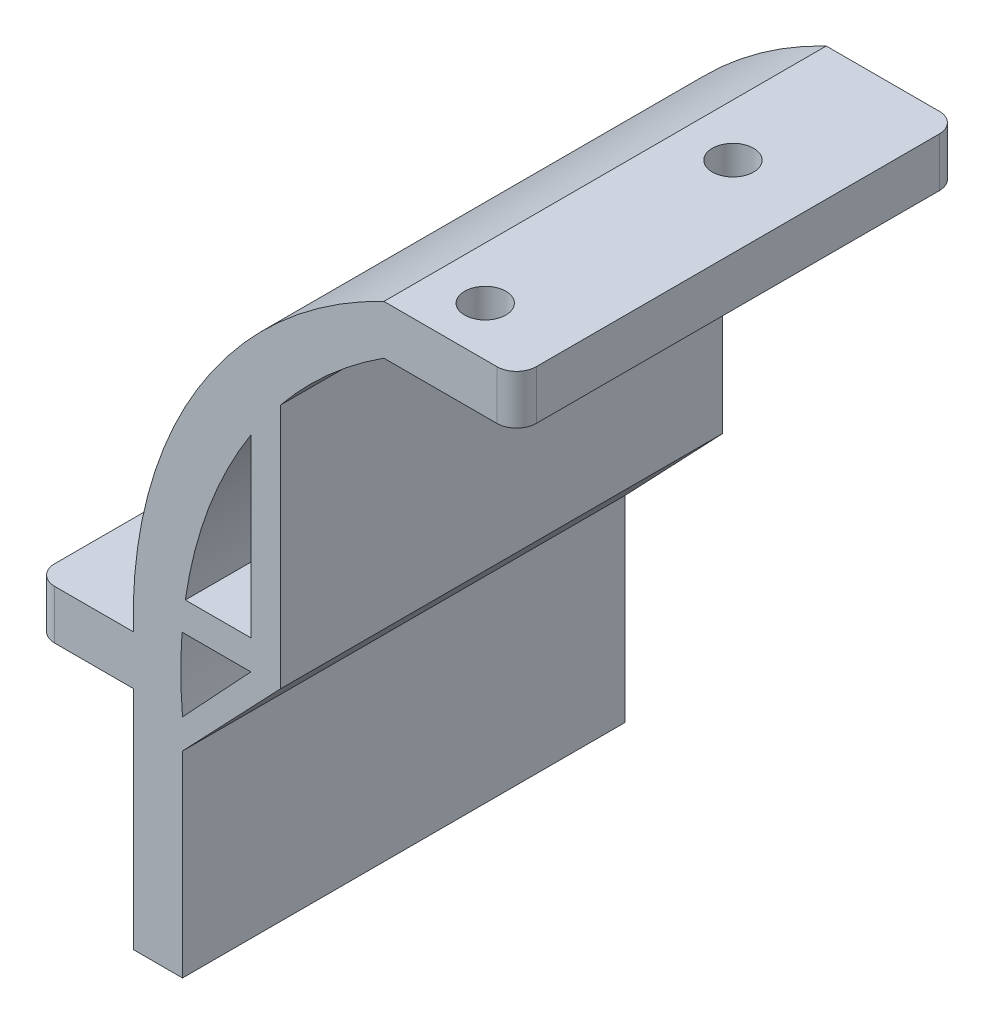
ISO-10303-21;
HEADER;
FILE_DESCRIPTION(('STEP AP214'),'2;1');
FILE_NAME('part.step','',(''),(''),'','','');
FILE_SCHEMA(('AUTOMOTIVE_DESIGN { 1 0 10303 214 1 1 1 1 }'));
ENDSEC;
DATA;
#1=APPLICATION_CONTEXT('core data for automotive mechanical design processes');
#2=APPLICATION_PROTOCOL_DEFINITION('international standard','automotive_design',2000,#1);
#3=PRODUCT_CONTEXT('',#1,'mechanical');
#4=PRODUCT('Part','Part','',(#3));
#5=PRODUCT_RELATED_PRODUCT_CATEGORY('part','',(#4));
#6=PRODUCT_DEFINITION_FORMATION('','',#4);
#7=PRODUCT_DEFINITION_CONTEXT('part definition',#1,'design');
#8=PRODUCT_DEFINITION('design','',#6,#7);
#9=PRODUCT_DEFINITION_SHAPE('','',#8);
#10=(LENGTH_UNIT() NAMED_UNIT(*) SI_UNIT(.MILLI.,.METRE.));
#11=(NAMED_UNIT(*) PLANE_ANGLE_UNIT() SI_UNIT($,.RADIAN.));
#12=(NAMED_UNIT(*) SI_UNIT($,.STERADIAN.) SOLID_ANGLE_UNIT());
#13=UNCERTAINTY_MEASURE_WITH_UNIT(LENGTH_MEASURE(1.E-05),#10,'distance_accuracy_value','');
#14=(GEOMETRIC_REPRESENTATION_CONTEXT(3) GLOBAL_UNCERTAINTY_ASSIGNED_CONTEXT((#13)) GLOBAL_UNIT_ASSIGNED_CONTEXT((#10,
#11,#12)) REPRESENTATION_CONTEXT('',''));
#15=CARTESIAN_POINT('',(0.,0.,0.));
#16=DIRECTION('',(0.,0.,1.));
#17=DIRECTION('',(1.,0.,0.));
#18=AXIS2_PLACEMENT_3D('',#15,#16,#17);
#19=CARTESIAN_POINT('',(19.2704077275692,219.412639915224,45.));
#20=DIRECTION('',(0.,0.,-1.));
#21=DIRECTION('',(-1.,0.,0.));
#22=AXIS2_PLACEMENT_3D('',#19,#20,#21);
#23=CYLINDRICAL_SURFACE('',#22,45.);
#24=DIRECTION('',(0.,0.,1.));
#25=VECTOR('',#24,1.);
#26=CARTESIAN_POINT('',(-25.5973694260722,222.859750776681,0.));
#27=LINE('',#26,#25);
#28=CARTESIAN_POINT('',(-25.5973694260722,222.859750776681,0.));
#29=VERTEX_POINT('',#28);
#30=CARTESIAN_POINT('',(-25.5973694260722,222.859750776681,45.));
#31=VERTEX_POINT('',#30);
#32=EDGE_CURVE('E216',#29,#31,#27,.T.);
#33=ORIENTED_EDGE('',*,*,#32,.T.);
#34=CARTESIAN_POINT('',(19.2704077275692,219.412639915224,45.));
#35=DIRECTION('',(0.,0.,1.));
#36=DIRECTION('',(1.,0.,0.));
#37=AXIS2_PLACEMENT_3D('',#34,#35,#36);
#38=CIRCLE('',#37,45.);
#39=CARTESIAN_POINT('',(-25.5516147708674,215.414352888303,45.));
#40=VERTEX_POINT('',#39);
#41=EDGE_CURVE('E293',#31,#40,#38,.T.);
#42=ORIENTED_EDGE('',*,*,#41,.T.);
#43=DIRECTION('',(0.,0.,-1.));
#44=VECTOR('',#43,1.);
#45=CARTESIAN_POINT('',(-25.5516147708674,215.414352888303,45.));
#46=LINE('',#45,#44);
#47=CARTESIAN_POINT('',(-25.5516147708674,215.414352888303,0.));
#48=VERTEX_POINT('',#47);
#49=EDGE_CURVE('E319',#40,#48,#46,.T.);
#50=ORIENTED_EDGE('',*,*,#49,.T.);
#51=CARTESIAN_POINT('',(19.2704077275692,219.412639915224,0.));
#52=DIRECTION('',(0.,0.,1.));
#53=DIRECTION('',(1.,0.,0.));
#54=AXIS2_PLACEMENT_3D('',#51,#52,#53);
#55=CIRCLE('',#54,45.);
#56=EDGE_CURVE('E209',#29,#48,#55,.T.);
#57=ORIENTED_EDGE('',*,*,#56,.F.);
#58=EDGE_LOOP('',(#33,#42,#50,#57));
#59=FACE_BOUND('',#58,.T.);
#60=ADVANCED_FACE('F39',(#59),#23,.F.);
#61=DIRECTION('',(0.,0.,1.));
#62=VECTOR('',#61,1.);
#63=CARTESIAN_POINT('',(-15.5973694260722,247.859750776681,0.));
#64=LINE('',#63,#62);
#65=CARTESIAN_POINT('',(-15.5973694260722,247.859750776681,0.));
#66=VERTEX_POINT('',#65);
#67=CARTESIAN_POINT('',(-15.5973694260722,247.859750776681,45.));
#68=VERTEX_POINT('',#67);
#69=EDGE_CURVE('E244',#66,#68,#64,.T.);
#70=ORIENTED_EDGE('',*,*,#69,.F.);
#71=CARTESIAN_POINT('',(-5.06519953005821,257.264696918807,0.));
#72=VERTEX_POINT('',#71);
#73=EDGE_CURVE('E320',#72,#66,#55,.T.);
#74=ORIENTED_EDGE('',*,*,#73,.F.);
#75=DIRECTION('',(0.,0.,-1.));
#76=VECTOR('',#75,1.);
#77=CARTESIAN_POINT('',(-5.06519953005821,257.264696918807,45.));
#78=LINE('',#77,#76);
#79=CARTESIAN_POINT('',(-5.06519953005821,257.264696918807,45.));
#80=VERTEX_POINT('',#79);
#81=EDGE_CURVE('E389',#80,#72,#78,.T.);
#82=ORIENTED_EDGE('',*,*,#81,.F.);
#83=EDGE_CURVE('E287',#80,#68,#38,.T.);
#84=ORIENTED_EDGE('',*,*,#83,.T.);
#85=EDGE_LOOP('',(#70,#74,#82,#84));
#86=FACE_BOUND('',#85,.T.);
#87=ADVANCED_FACE('F467',(#86),#23,.F.);
#88=DIRECTION('',(0.,0.,1.));
#89=VECTOR('',#88,1.);
#90=CARTESIAN_POINT('',(-25.2653617340679,225.859750776681,0.));
#91=LINE('',#90,#89);
#92=CARTESIAN_POINT('',(-25.2653617340679,225.859750776681,0.));
#93=VERTEX_POINT('',#92);
#94=CARTESIAN_POINT('',(-25.2653617340679,225.859750776681,45.));
#95=VERTEX_POINT('',#94);
#96=EDGE_CURVE('E254',#93,#95,#91,.T.);
#97=ORIENTED_EDGE('',*,*,#96,.F.);
#98=CARTESIAN_POINT('',(-18.5973694260722,243.723778379767,0.));
#99=VERTEX_POINT('',#98);
#100=EDGE_CURVE('E325',#99,#93,#55,.T.);
#101=ORIENTED_EDGE('',*,*,#100,.F.);
#102=DIRECTION('',(0.,0.,1.));
#103=VECTOR('',#102,1.);
#104=CARTESIAN_POINT('',(-18.5973694260722,243.723778379767,0.));
#105=LINE('',#104,#103);
#106=CARTESIAN_POINT('',(-18.5973694260722,243.723778379767,45.));
#107=VERTEX_POINT('',#106);
#108=EDGE_CURVE('E223',#99,#107,#105,.T.);
#109=ORIENTED_EDGE('',*,*,#108,.T.);
#110=EDGE_CURVE('E292',#107,#95,#38,.T.);
#111=ORIENTED_EDGE('',*,*,#110,.T.);
#112=EDGE_LOOP('',(#97,#101,#109,#111));
#113=FACE_BOUND('',#112,.T.);
#114=ADVANCED_FACE('F470',(#113),#23,.F.);
#115=CARTESIAN_POINT('',(0.,257.264696918807,45.));
#116=DIRECTION('',(0.,-1.,0.));
#117=DIRECTION('',(0.,0.,-1.));
#118=AXIS2_PLACEMENT_3D('',#115,#116,#117);
#119=PLANE('',#118);
#120=CARTESIAN_POINT('',(0.244800469941791,257.264696918807,40.));
#121=DIRECTION('',(0.,-1.,0.));
#122=DIRECTION('',(0.,0.,-1.));
#123=AXIS2_PLACEMENT_3D('',#120,#121,#122);
#124=CIRCLE('',#123,2.1);
#125=CARTESIAN_POINT('',(0.244800469941791,257.264696918807,37.9));
#126=VERTEX_POINT('',#125);
#127=EDGE_CURVE('E283',#126,#126,#124,.T.);
#128=ORIENTED_EDGE('',*,*,#127,.F.);
#129=EDGE_LOOP('',(#128));
#130=FACE_BOUND('',#129,.T.);
#131=CARTESIAN_POINT('',(0.244800469941791,257.264696918807,14.8));
#132=DIRECTION('',(0.,-1.,0.));
#133=DIRECTION('',(0.,0.,-1.));
#134=AXIS2_PLACEMENT_3D('',#131,#132,#133);
#135=CIRCLE('',#134,2.1);
#136=CARTESIAN_POINT('',(0.244800469941791,257.264696918807,12.7));
#137=VERTEX_POINT('',#136);
#138=EDGE_CURVE('E275',#137,#137,#135,.T.);
#139=ORIENTED_EDGE('',*,*,#138,.F.);
#140=EDGE_LOOP('',(#139));
#141=FACE_BOUND('',#140,.T.);
#142=DIRECTION('',(-1.,0.,0.));
#143=VECTOR('',#142,1.);
#144=CARTESIAN_POINT('',(0.,257.264696918807,0.));
#145=LINE('',#144,#143);
#146=CARTESIAN_POINT('',(6.43480046994179,257.264696918807,0.));
#147=VERTEX_POINT('',#146);
#148=EDGE_CURVE('E324',#147,#72,#145,.T.);
#149=ORIENTED_EDGE('',*,*,#148,.F.);
#150=CARTESIAN_POINT('',(6.43480046994179,257.264696918807,2.));
#151=DIRECTION('',(0.,-1.,0.));
#152=DIRECTION('',(0.,0.,-1.));
#153=AXIS2_PLACEMENT_3D('',#150,#151,#152);
#154=CIRCLE('',#153,2.);
#155=CARTESIAN_POINT('',(8.43480046994179,257.264696918807,2.00000000000002));
#156=VERTEX_POINT('',#155);
#157=EDGE_CURVE('E429',#147,#156,#154,.T.);
#158=ORIENTED_EDGE('',*,*,#157,.T.);
#159=DIRECTION('',(0.,0.,-1.));
#160=VECTOR('',#159,1.);
#161=CARTESIAN_POINT('',(8.43480046994179,257.264696918807,45.));
#162=LINE('',#161,#160);
#163=CARTESIAN_POINT('',(8.43480046994179,257.264696918807,43.));
#164=VERTEX_POINT('',#163);
#165=EDGE_CURVE('E385',#164,#156,#162,.T.);
#166=ORIENTED_EDGE('',*,*,#165,.F.);
#167=CARTESIAN_POINT('',(6.43480046994179,257.264696918807,43.));
#168=DIRECTION('',(0.,-1.,0.));
#169=DIRECTION('',(0.,0.,-1.));
#170=AXIS2_PLACEMENT_3D('',#167,#168,#169);
#171=CIRCLE('',#170,2.);
#172=CARTESIAN_POINT('',(6.43480046994179,257.264696918807,45.));
#173=VERTEX_POINT('',#172);
#174=EDGE_CURVE('E426',#164,#173,#171,.T.);
#175=ORIENTED_EDGE('',*,*,#174,.T.);
#176=DIRECTION('',(-1.,0.,0.));
#177=VECTOR('',#176,1.);
#178=CARTESIAN_POINT('',(0.,257.264696918807,45.));
#179=LINE('',#178,#177);
#180=EDGE_CURVE('E291',#173,#80,#179,.T.);
#181=ORIENTED_EDGE('',*,*,#180,.T.);
#182=ORIENTED_EDGE('',*,*,#81,.T.);
#183=EDGE_LOOP('',(#149,#158,#166,#175,#181,#182));
#184=FACE_BOUND('',#183,.T.);
#185=ADVANCED_FACE('F478',(#130,#141,#184),#119,.T.);
#186=CARTESIAN_POINT('',(8.43480046994179,0.,45.));
#187=DIRECTION('',(1.,0.,0.));
#188=DIRECTION('',(0.,0.,-1.));
#189=AXIS2_PLACEMENT_3D('',#186,#187,#188);
#190=PLANE('',#189);
#191=ORIENTED_EDGE('',*,*,#165,.T.);
#192=DIRECTION('',(0.,-1.,0.));
#193=VECTOR('',#192,1.);
#194=CARTESIAN_POINT('',(8.43480046994179,262.264696918807,2.));
#195=LINE('',#194,#193);
#196=CARTESIAN_POINT('',(8.43480046994179,262.264696918807,2.00000000000002));
#197=VERTEX_POINT('',#196);
#198=EDGE_CURVE('E436',#156,#197,#195,.F.);
#199=ORIENTED_EDGE('',*,*,#198,.T.);
#200=DIRECTION('',(0.,0.,-1.));
#201=VECTOR('',#200,1.);
#202=CARTESIAN_POINT('',(8.43480046994179,262.264696918807,45.));
#203=LINE('',#202,#201);
#204=CARTESIAN_POINT('',(8.43480046994179,262.264696918807,43.));
#205=VERTEX_POINT('',#204);
#206=EDGE_CURVE('E381',#205,#197,#203,.T.);
#207=ORIENTED_EDGE('',*,*,#206,.F.);
#208=DIRECTION('',(0.,-1.,0.));
#209=VECTOR('',#208,1.);
#210=CARTESIAN_POINT('',(8.43480046994179,0.,43.));
#211=LINE('',#210,#209);
#212=EDGE_CURVE('E432',#205,#164,#211,.T.);
#213=ORIENTED_EDGE('',*,*,#212,.T.);
#214=EDGE_LOOP('',(#191,#199,#207,#213));
#215=FACE_BOUND('',#214,.T.);
#216=ADVANCED_FACE('F483',(#215),#190,.T.);
#217=CARTESIAN_POINT('',(0.,262.264696918807,45.));
#218=DIRECTION('',(0.,-1.,0.));
#219=DIRECTION('',(0.,0.,-1.));
#220=AXIS2_PLACEMENT_3D('',#217,#218,#219);
#221=PLANE('',#220);
#222=CARTESIAN_POINT('',(0.244800469941791,262.264696918807,40.));
#223=DIRECTION('',(0.,1.,0.));
#224=DIRECTION('',(0.,0.,1.));
#225=AXIS2_PLACEMENT_3D('',#222,#223,#224);
#226=CIRCLE('',#225,2.1);
#227=CARTESIAN_POINT('',(0.244800469941791,262.264696918807,42.1));
#228=VERTEX_POINT('',#227);
#229=EDGE_CURVE('E271',#228,#228,#226,.T.);
#230=ORIENTED_EDGE('',*,*,#229,.F.);
#231=EDGE_LOOP('',(#230));
#232=FACE_BOUND('',#231,.T.);
#233=CARTESIAN_POINT('',(0.244800469941791,262.264696918807,14.8));
#234=DIRECTION('',(0.,1.,0.));
#235=DIRECTION('',(0.,0.,1.));
#236=AXIS2_PLACEMENT_3D('',#233,#234,#235);
#237=CIRCLE('',#236,2.1);
#238=CARTESIAN_POINT('',(0.244800469941791,262.264696918807,16.9));
#239=VERTEX_POINT('',#238);
#240=EDGE_CURVE('E276',#239,#239,#237,.T.);
#241=ORIENTED_EDGE('',*,*,#240,.F.);
#242=EDGE_LOOP('',(#241));
#243=FACE_BOUND('',#242,.T.);
#244=ORIENTED_EDGE('',*,*,#206,.T.);
#245=CARTESIAN_POINT('',(6.43480046994179,262.264696918807,2.));
#246=DIRECTION('',(0.,-1.,0.));
#247=DIRECTION('',(0.,0.,-1.));
#248=AXIS2_PLACEMENT_3D('',#245,#246,#247);
#249=CIRCLE('',#248,2.);
#250=CARTESIAN_POINT('',(6.43480046994179,262.264696918807,0.));
#251=VERTEX_POINT('',#250);
#252=EDGE_CURVE('E11',#197,#251,#249,.F.);
#253=ORIENTED_EDGE('',*,*,#252,.T.);
#254=DIRECTION('',(-1.,0.,0.));
#255=VECTOR('',#254,1.);
#256=CARTESIAN_POINT('',(0.,262.264696918807,0.));
#257=LINE('',#256,#255);
#258=CARTESIAN_POINT('',(-5.06519953005821,262.264696918807,0.));
#259=VERTEX_POINT('',#258);
#260=EDGE_CURVE('E328',#251,#259,#257,.T.);
#261=ORIENTED_EDGE('',*,*,#260,.T.);
#262=DIRECTION('',(0.,0.,-1.));
#263=VECTOR('',#262,1.);
#264=CARTESIAN_POINT('',(-5.06519953005821,262.264696918807,45.));
#265=LINE('',#264,#263);
#266=CARTESIAN_POINT('',(-5.06519953005821,262.264696918807,45.));
#267=VERTEX_POINT('',#266);
#268=EDGE_CURVE('E377',#267,#259,#265,.T.);
#269=ORIENTED_EDGE('',*,*,#268,.F.);
#270=DIRECTION('',(-1.,0.,0.));
#271=VECTOR('',#270,1.);
#272=CARTESIAN_POINT('',(0.,262.264696918807,45.));
#273=LINE('',#272,#271);
#274=CARTESIAN_POINT('',(6.43480046994179,262.264696918807,45.));
#275=VERTEX_POINT('',#274);
#276=EDGE_CURVE('E296',#275,#267,#273,.T.);
#277=ORIENTED_EDGE('',*,*,#276,.F.);
#278=CARTESIAN_POINT('',(6.43480046994179,262.264696918807,43.));
#279=DIRECTION('',(0.,-1.,0.));
#280=DIRECTION('',(0.,0.,-1.));
#281=AXIS2_PLACEMENT_3D('',#278,#279,#280);
#282=CIRCLE('',#281,2.);
#283=EDGE_CURVE('E49',#275,#205,#282,.F.);
#284=ORIENTED_EDGE('',*,*,#283,.T.);
#285=EDGE_LOOP('',(#244,#253,#261,#269,#277,#284));
#286=FACE_BOUND('',#285,.T.);
#287=ADVANCED_FACE('F593',(#232,#243,#286),#221,.F.);
#288=CARTESIAN_POINT('',(14.4298215899234,221.70678583439,45.));
#289=DIRECTION('',(0.,0.,-1.));
#290=DIRECTION('',(-1.,0.,0.));
#291=AXIS2_PLACEMENT_3D('',#288,#289,#290);
#292=CYLINDRICAL_SURFACE('',#291,45.);
#293=CARTESIAN_POINT('',(14.4298215899234,221.70678583439,0.));
#294=DIRECTION('',(0.,0.,1.));
#295=DIRECTION('',(1.,0.,0.));
#296=AXIS2_PLACEMENT_3D('',#293,#294,#295);
#297=CIRCLE('',#296,45.);
#298=CARTESIAN_POINT('',(-30.5516147708674,220.414352888303,0.));
#299=VERTEX_POINT('',#298);
#300=EDGE_CURVE('E331',#299,#259,#297,.F.);
#301=ORIENTED_EDGE('',*,*,#300,.F.);
#302=DIRECTION('',(0.,0.,-1.));
#303=VECTOR('',#302,1.);
#304=CARTESIAN_POINT('',(-30.5516147708674,220.414352888303,45.));
#305=LINE('',#304,#303);
#306=CARTESIAN_POINT('',(-30.5516147708674,220.414352888303,45.));
#307=VERTEX_POINT('',#306);
#308=EDGE_CURVE('E373',#307,#299,#305,.T.);
#309=ORIENTED_EDGE('',*,*,#308,.F.);
#310=CARTESIAN_POINT('',(14.4298215899234,221.70678583439,45.));
#311=DIRECTION('',(0.,0.,1.));
#312=DIRECTION('',(1.,0.,0.));
#313=AXIS2_PLACEMENT_3D('',#310,#311,#312);
#314=CIRCLE('',#313,45.);
#315=EDGE_CURVE('E299',#307,#267,#314,.F.);
#316=ORIENTED_EDGE('',*,*,#315,.T.);
#317=ORIENTED_EDGE('',*,*,#268,.T.);
#318=EDGE_LOOP('',(#301,#309,#316,#317));
#319=FACE_BOUND('',#318,.T.);
#320=ADVANCED_FACE('F569',(#319),#292,.T.);
#321=CARTESIAN_POINT('',(0.,220.414352888303,45.));
#322=DIRECTION('',(0.,1.,0.));
#323=DIRECTION('',(0.,0.,1.));
#324=AXIS2_PLACEMENT_3D('',#321,#322,#323);
#325=PLANE('',#324);
#326=CARTESIAN_POINT('',(-35.5516147708674,220.414352888303,10.));
#327=DIRECTION('',(0.,1.,0.));
#328=DIRECTION('',(0.,0.,1.));
#329=AXIS2_PLACEMENT_3D('',#326,#327,#328);
#330=CIRCLE('',#329,2.1);
#331=CARTESIAN_POINT('',(-35.5516147708674,220.414352888303,12.1));
#332=VERTEX_POINT('',#331);
#333=EDGE_CURVE('E263',#332,#332,#330,.T.);
#334=ORIENTED_EDGE('',*,*,#333,.F.);
#335=EDGE_LOOP('',(#334));
#336=FACE_BOUND('',#335,.T.);
#337=CARTESIAN_POINT('',(-35.5516147708674,220.414352888303,35.));
#338=DIRECTION('',(0.,1.,0.));
#339=DIRECTION('',(0.,0.,1.));
#340=AXIS2_PLACEMENT_3D('',#337,#338,#339);
#341=CIRCLE('',#340,2.1);
#342=CARTESIAN_POINT('',(-35.5516147708674,220.414352888303,37.1));
#343=VERTEX_POINT('',#342);
#344=EDGE_CURVE('E247',#343,#343,#341,.T.);
#345=ORIENTED_EDGE('',*,*,#344,.F.);
#346=EDGE_LOOP('',(#345));
#347=FACE_BOUND('',#346,.T.);
#348=DIRECTION('',(0.,0.,-1.));
#349=VECTOR('',#348,1.);
#350=CARTESIAN_POINT('',(-40.5516147708674,220.414352888303,45.));
#351=LINE('',#350,#349);
#352=CARTESIAN_POINT('',(-40.5516147708674,220.414352888303,43.));
#353=VERTEX_POINT('',#352);
#354=CARTESIAN_POINT('',(-40.5516147708674,220.414352888303,2.00000000000002));
#355=VERTEX_POINT('',#354);
#356=EDGE_CURVE('E369',#353,#355,#351,.T.);
#357=ORIENTED_EDGE('',*,*,#356,.F.);
#358=CARTESIAN_POINT('',(-38.5516147708674,220.414352888303,43.));
#359=DIRECTION('',(0.,1.,0.));
#360=DIRECTION('',(0.,0.,1.));
#361=AXIS2_PLACEMENT_3D('',#358,#359,#360);
#362=CIRCLE('',#361,2.);
#363=CARTESIAN_POINT('',(-38.5516147708674,220.414352888303,45.));
#364=VERTEX_POINT('',#363);
#365=EDGE_CURVE('E403',#353,#364,#362,.T.);
#366=ORIENTED_EDGE('',*,*,#365,.T.);
#367=DIRECTION('',(1.,0.,0.));
#368=VECTOR('',#367,1.);
#369=CARTESIAN_POINT('',(0.,220.414352888303,45.));
#370=LINE('',#369,#368);
#371=EDGE_CURVE('E303',#364,#307,#370,.T.);
#372=ORIENTED_EDGE('',*,*,#371,.T.);
#373=ORIENTED_EDGE('',*,*,#308,.T.);
#374=DIRECTION('',(1.,0.,0.));
#375=VECTOR('',#374,1.);
#376=CARTESIAN_POINT('',(0.,220.414352888303,0.));
#377=LINE('',#376,#375);
#378=CARTESIAN_POINT('',(-38.5516147708674,220.414352888303,0.));
#379=VERTEX_POINT('',#378);
#380=EDGE_CURVE('E335',#379,#299,#377,.T.);
#381=ORIENTED_EDGE('',*,*,#380,.F.);
#382=CARTESIAN_POINT('',(-38.5516147708674,220.414352888303,2.));
#383=DIRECTION('',(0.,1.,0.));
#384=DIRECTION('',(0.,0.,1.));
#385=AXIS2_PLACEMENT_3D('',#382,#383,#384);
#386=CIRCLE('',#385,2.);
#387=EDGE_CURVE('E400',#379,#355,#386,.T.);
#388=ORIENTED_EDGE('',*,*,#387,.T.);
#389=EDGE_LOOP('',(#357,#366,#372,#373,#381,#388));
#390=FACE_BOUND('',#389,.T.);
#391=ADVANCED_FACE('F563',(#336,#347,#390),#325,.T.);
#392=CARTESIAN_POINT('',(-40.5516147708674,0.,45.));
#393=DIRECTION('',(-1.,0.,0.));
#394=DIRECTION('',(0.,0.,1.));
#395=AXIS2_PLACEMENT_3D('',#392,#393,#394);
#396=PLANE('',#395);
#397=DIRECTION('',(0.,0.,-1.));
#398=VECTOR('',#397,1.);
#399=CARTESIAN_POINT('',(-40.5516147708674,215.414352888303,45.));
#400=LINE('',#399,#398);
#401=CARTESIAN_POINT('',(-40.5516147708674,215.414352888303,43.));
#402=VERTEX_POINT('',#401);
#403=CARTESIAN_POINT('',(-40.5516147708674,215.414352888303,2.00000000000002));
#404=VERTEX_POINT('',#403);
#405=EDGE_CURVE('E365',#402,#404,#400,.T.);
#406=ORIENTED_EDGE('',*,*,#405,.F.);
#407=DIRECTION('',(0.,1.,0.));
#408=VECTOR('',#407,1.);
#409=CARTESIAN_POINT('',(-40.5516147708674,0.,43.));
#410=LINE('',#409,#408);
#411=EDGE_CURVE('E396',#402,#353,#410,.T.);
#412=ORIENTED_EDGE('',*,*,#411,.T.);
#413=ORIENTED_EDGE('',*,*,#356,.T.);
#414=DIRECTION('',(0.,1.,0.));
#415=VECTOR('',#414,1.);
#416=CARTESIAN_POINT('',(-40.5516147708674,215.414352888303,2.));
#417=LINE('',#416,#415);
#418=EDGE_CURVE('E393',#355,#404,#417,.F.);
#419=ORIENTED_EDGE('',*,*,#418,.T.);
#420=EDGE_LOOP('',(#406,#412,#413,#419));
#421=FACE_BOUND('',#420,.T.);
#422=ADVANCED_FACE('F599',(#421),#396,.T.);
#423=CARTESIAN_POINT('',(0.,215.414352888303,45.));
#424=DIRECTION('',(0.,1.,0.));
#425=DIRECTION('',(0.,0.,1.));
#426=AXIS2_PLACEMENT_3D('',#423,#424,#425);
#427=PLANE('',#426);
#428=CARTESIAN_POINT('',(-35.5516147708674,215.414352888303,10.));
#429=DIRECTION('',(0.,1.,0.));
#430=DIRECTION('',(0.,0.,1.));
#431=AXIS2_PLACEMENT_3D('',#428,#429,#430);
#432=CIRCLE('',#431,2.1);
#433=CARTESIAN_POINT('',(-35.5516147708674,215.414352888303,12.1));
#434=VERTEX_POINT('',#433);
#435=EDGE_CURVE('E43',#434,#434,#432,.T.);
#436=ORIENTED_EDGE('',*,*,#435,.T.);
#437=EDGE_LOOP('',(#436));
#438=FACE_BOUND('',#437,.T.);
#439=CARTESIAN_POINT('',(-35.5516147708674,215.414352888303,35.));
#440=DIRECTION('',(0.,1.,0.));
#441=DIRECTION('',(0.,0.,1.));
#442=AXIS2_PLACEMENT_3D('',#439,#440,#441);
#443=CIRCLE('',#442,2.1);
#444=CARTESIAN_POINT('',(-35.5516147708674,215.414352888303,37.1));
#445=VERTEX_POINT('',#444);
#446=EDGE_CURVE('E267',#445,#445,#443,.T.);
#447=ORIENTED_EDGE('',*,*,#446,.T.);
#448=EDGE_LOOP('',(#447));
#449=FACE_BOUND('',#448,.T.);
#450=DIRECTION('',(1.,0.,0.));
#451=VECTOR('',#450,1.);
#452=CARTESIAN_POINT('',(0.,215.414352888303,45.));
#453=LINE('',#452,#451);
#454=CARTESIAN_POINT('',(-38.5516147708674,215.414352888303,45.));
#455=VERTEX_POINT('',#454);
#456=CARTESIAN_POINT('',(-30.5516147708674,215.414352888303,45.));
#457=VERTEX_POINT('',#456);
#458=EDGE_CURVE('E306',#455,#457,#453,.T.);
#459=ORIENTED_EDGE('',*,*,#458,.F.);
#460=CARTESIAN_POINT('',(-38.5516147708674,215.414352888303,43.));
#461=DIRECTION('',(0.,1.,0.));
#462=DIRECTION('',(0.,0.,1.));
#463=AXIS2_PLACEMENT_3D('',#460,#461,#462);
#464=CIRCLE('',#463,2.);
#465=EDGE_CURVE('E415',#455,#402,#464,.F.);
#466=ORIENTED_EDGE('',*,*,#465,.T.);
#467=ORIENTED_EDGE('',*,*,#405,.T.);
#468=CARTESIAN_POINT('',(-38.5516147708674,215.414352888303,2.));
#469=DIRECTION('',(0.,1.,0.));
#470=DIRECTION('',(0.,0.,1.));
#471=AXIS2_PLACEMENT_3D('',#468,#469,#470);
#472=CIRCLE('',#471,2.);
#473=CARTESIAN_POINT('',(-38.5516147708674,215.414352888303,0.));
#474=VERTEX_POINT('',#473);
#475=EDGE_CURVE('E412',#404,#474,#472,.F.);
#476=ORIENTED_EDGE('',*,*,#475,.T.);
#477=DIRECTION('',(1.,0.,0.));
#478=VECTOR('',#477,1.);
#479=CARTESIAN_POINT('',(0.,215.414352888303,0.));
#480=LINE('',#479,#478);
#481=CARTESIAN_POINT('',(-30.5516147708674,215.414352888303,0.));
#482=VERTEX_POINT('',#481);
#483=EDGE_CURVE('E338',#474,#482,#480,.T.);
#484=ORIENTED_EDGE('',*,*,#483,.T.);
#485=DIRECTION('',(0.,0.,-1.));
#486=VECTOR('',#485,1.);
#487=CARTESIAN_POINT('',(-30.5516147708674,215.414352888303,45.));
#488=LINE('',#487,#486);
#489=EDGE_CURVE('E361',#457,#482,#488,.T.);
#490=ORIENTED_EDGE('',*,*,#489,.F.);
#491=EDGE_LOOP('',(#459,#466,#467,#476,#484,#490));
#492=FACE_BOUND('',#491,.T.);
#493=ADVANCED_FACE('F448',(#438,#449,#492),#427,.F.);
#494=CARTESIAN_POINT('',(-30.5516147708674,0.,45.));
#495=DIRECTION('',(1.,0.,0.));
#496=DIRECTION('',(0.,0.,-1.));
#497=AXIS2_PLACEMENT_3D('',#494,#495,#496);
#498=PLANE('',#497);
#499=DIRECTION('',(0.,-1.,0.));
#500=VECTOR('',#499,1.);
#501=CARTESIAN_POINT('',(-30.5516147708674,0.,0.));
#502=LINE('',#501,#500);
#503=CARTESIAN_POINT('',(-30.5516147708674,192.414352888303,0.));
#504=VERTEX_POINT('',#503);
#505=EDGE_CURVE('E341',#482,#504,#502,.T.);
#506=ORIENTED_EDGE('',*,*,#505,.T.);
#507=DIRECTION('',(0.,0.,-1.));
#508=VECTOR('',#507,1.);
#509=CARTESIAN_POINT('',(-30.5516147708674,192.414352888303,45.));
#510=LINE('',#509,#508);
#511=CARTESIAN_POINT('',(-30.5516147708674,192.414352888303,45.));
#512=VERTEX_POINT('',#511);
#513=EDGE_CURVE('E357',#512,#504,#510,.T.);
#514=ORIENTED_EDGE('',*,*,#513,.F.);
#515=DIRECTION('',(0.,-1.,0.));
#516=VECTOR('',#515,1.);
#517=CARTESIAN_POINT('',(-30.5516147708674,0.,45.));
#518=LINE('',#517,#516);
#519=EDGE_CURVE('E309',#457,#512,#518,.T.);
#520=ORIENTED_EDGE('',*,*,#519,.F.);
#521=ORIENTED_EDGE('',*,*,#489,.T.);
#522=EDGE_LOOP('',(#506,#514,#520,#521));
#523=FACE_BOUND('',#522,.T.);
#524=ADVANCED_FACE('F550',(#523),#498,.F.);
#525=CARTESIAN_POINT('',(0.,192.414352888303,45.));
#526=DIRECTION('',(0.,1.,0.));
#527=DIRECTION('',(0.,0.,1.));
#528=AXIS2_PLACEMENT_3D('',#525,#526,#527);
#529=PLANE('',#528);
#530=DIRECTION('',(1.,0.,0.));
#531=VECTOR('',#530,1.);
#532=CARTESIAN_POINT('',(0.,192.414352888303,0.));
#533=LINE('',#532,#531);
#534=CARTESIAN_POINT('',(-25.5516147708674,192.414352888303,0.));
#535=VERTEX_POINT('',#534);
#536=EDGE_CURVE('E344',#504,#535,#533,.T.);
#537=ORIENTED_EDGE('',*,*,#536,.T.);
#538=DIRECTION('',(0.,0.,-1.));
#539=VECTOR('',#538,1.);
#540=CARTESIAN_POINT('',(-25.5516147708674,192.414352888303,45.));
#541=LINE('',#540,#539);
#542=CARTESIAN_POINT('',(-25.5516147708674,192.414352888303,45.));
#543=VERTEX_POINT('',#542);
#544=EDGE_CURVE('E353',#543,#535,#541,.T.);
#545=ORIENTED_EDGE('',*,*,#544,.F.);
#546=DIRECTION('',(1.,0.,0.));
#547=VECTOR('',#546,1.);
#548=CARTESIAN_POINT('',(0.,192.414352888303,45.));
#549=LINE('',#548,#547);
#550=EDGE_CURVE('E312',#512,#543,#549,.T.);
#551=ORIENTED_EDGE('',*,*,#550,.F.);
#552=ORIENTED_EDGE('',*,*,#513,.T.);
#553=EDGE_LOOP('',(#537,#545,#551,#552));
#554=FACE_BOUND('',#553,.T.);
#555=ADVANCED_FACE('F544',(#554),#529,.F.);
#556=CARTESIAN_POINT('',(-25.5516147708674,0.,45.));
#557=DIRECTION('',(1.,0.,0.));
#558=DIRECTION('',(0.,0.,-1.));
#559=AXIS2_PLACEMENT_3D('',#556,#557,#558);
#560=PLANE('',#559);
#561=DIRECTION('',(0.,0.,1.));
#562=VECTOR('',#561,1.);
#563=CARTESIAN_POINT('',(-25.5516147708674,212.414352888303,0.));
#564=LINE('',#563,#562);
#565=CARTESIAN_POINT('',(-25.5516147708674,212.414352888303,0.));
#566=VERTEX_POINT('',#565);
#567=CARTESIAN_POINT('',(-25.5516147708674,212.414352888303,45.));
#568=VERTEX_POINT('',#567);
#569=EDGE_CURVE('E205',#566,#568,#564,.T.);
#570=ORIENTED_EDGE('',*,*,#569,.T.);
#571=DIRECTION('',(0.,-1.,0.));
#572=VECTOR('',#571,1.);
#573=CARTESIAN_POINT('',(-25.5516147708674,0.,45.));
#574=LINE('',#573,#572);
#575=EDGE_CURVE('E316',#568,#543,#574,.T.);
#576=ORIENTED_EDGE('',*,*,#575,.T.);
#577=ORIENTED_EDGE('',*,*,#544,.T.);
#578=DIRECTION('',(0.,-1.,0.));
#579=VECTOR('',#578,1.);
#580=CARTESIAN_POINT('',(-25.5516147708674,0.,0.));
#581=LINE('',#580,#579);
#582=EDGE_CURVE('E348',#566,#535,#581,.T.);
#583=ORIENTED_EDGE('',*,*,#582,.F.);
#584=EDGE_LOOP('',(#570,#576,#577,#583));
#585=FACE_BOUND('',#584,.T.);
#586=ADVANCED_FACE('F538',(#585),#560,.T.);
#587=CARTESIAN_POINT('',(0.,0.,45.));
#588=DIRECTION('',(0.,0.,1.));
#589=DIRECTION('',(1.,0.,0.));
#590=AXIS2_PLACEMENT_3D('',#587,#588,#589);
#591=PLANE('',#590);
#592=ORIENTED_EDGE('',*,*,#575,.F.);
#593=DIRECTION('',(0.689882180109041,0.72392166535337,0.));
#594=VECTOR('',#593,1.);
#595=CARTESIAN_POINT('',(-15.5973694260722,222.859750776681,45.));
#596=LINE('',#595,#594);
#597=CARTESIAN_POINT('',(-15.5973694260722,222.859750776681,45.));
#598=VERTEX_POINT('',#597);
#599=EDGE_CURVE('E212',#568,#598,#596,.T.);
#600=ORIENTED_EDGE('',*,*,#599,.T.);
#601=DIRECTION('',(0.,1.,0.));
#602=VECTOR('',#601,1.);
#603=CARTESIAN_POINT('',(-15.5973694260722,247.859750776681,45.));
#604=LINE('',#603,#602);
#605=EDGE_CURVE('E240',#598,#68,#604,.T.);
#606=ORIENTED_EDGE('',*,*,#605,.T.);
#607=ORIENTED_EDGE('',*,*,#83,.F.);
#608=ORIENTED_EDGE('',*,*,#180,.F.);
#609=DIRECTION('',(0.,-1.,0.));
#610=VECTOR('',#609,1.);
#611=CARTESIAN_POINT('',(6.43480046994179,0.,45.));
#612=LINE('',#611,#610);
#613=EDGE_CURVE('E406',#173,#275,#612,.F.);
#614=ORIENTED_EDGE('',*,*,#613,.T.);
#615=ORIENTED_EDGE('',*,*,#276,.T.);
#616=ORIENTED_EDGE('',*,*,#315,.F.);
#617=ORIENTED_EDGE('',*,*,#371,.F.);
#618=DIRECTION('',(0.,1.,0.));
#619=VECTOR('',#618,1.);
#620=CARTESIAN_POINT('',(-38.5516147708674,0.,45.));
#621=LINE('',#620,#619);
#622=EDGE_CURVE('E409',#364,#455,#621,.F.);
#623=ORIENTED_EDGE('',*,*,#622,.T.);
#624=ORIENTED_EDGE('',*,*,#458,.T.);
#625=ORIENTED_EDGE('',*,*,#519,.T.);
#626=ORIENTED_EDGE('',*,*,#550,.T.);
#627=EDGE_LOOP('',(#592,#600,#606,#607,#608,#614,#615,#616,#617,#623,#624,#625,#626));
#628=FACE_BOUND('',#627,.T.);
#629=ORIENTED_EDGE('',*,*,#110,.F.);
#630=DIRECTION('',(0.,-1.,0.));
#631=VECTOR('',#630,1.);
#632=CARTESIAN_POINT('',(-18.5973694260722,243.723778379767,45.));
#633=LINE('',#632,#631);
#634=CARTESIAN_POINT('',(-18.5973694260722,225.859750776681,45.));
#635=VERTEX_POINT('',#634);
#636=EDGE_CURVE('E229',#107,#635,#633,.T.);
#637=ORIENTED_EDGE('',*,*,#636,.T.);
#638=DIRECTION('',(-1.,0.,0.));
#639=VECTOR('',#638,1.);
#640=CARTESIAN_POINT('',(-18.5973694260722,225.859750776681,45.));
#641=LINE('',#640,#639);
#642=EDGE_CURVE('E233',#635,#95,#641,.T.);
#643=ORIENTED_EDGE('',*,*,#642,.T.);
#644=EDGE_LOOP('',(#629,#637,#643));
#645=FACE_BOUND('',#644,.T.);
#646=DIRECTION('',(-0.682591367762053,-0.730800263175055,0.));
#647=VECTOR('',#646,1.);
#648=CARTESIAN_POINT('',(-18.5973694260722,222.859750776681,45.));
#649=LINE('',#648,#647);
#650=CARTESIAN_POINT('',(-18.5973694260722,222.859750776681,45.));
#651=VERTEX_POINT('',#650);
#652=EDGE_CURVE('E201',#651,#40,#649,.T.);
#653=ORIENTED_EDGE('',*,*,#652,.T.);
#654=ORIENTED_EDGE('',*,*,#41,.F.);
#655=DIRECTION('',(1.,0.,0.));
#656=VECTOR('',#655,1.);
#657=CARTESIAN_POINT('',(-15.5973694260722,222.859750776681,45.));
#658=LINE('',#657,#656);
#659=EDGE_CURVE('E237',#31,#651,#658,.T.);
#660=ORIENTED_EDGE('',*,*,#659,.T.);
#661=EDGE_LOOP('',(#653,#654,#660));
#662=FACE_BOUND('',#661,.T.);
#663=ADVANCED_FACE('F503',(#628,#645,#662),#591,.T.);
#664=CARTESIAN_POINT('',(0.,0.,0.));
#665=DIRECTION('',(0.,0.,1.));
#666=DIRECTION('',(1.,0.,0.));
#667=AXIS2_PLACEMENT_3D('',#664,#665,#666);
#668=PLANE('',#667);
#669=DIRECTION('',(0.689882180109041,0.72392166535337,0.));
#670=VECTOR('',#669,1.);
#671=CARTESIAN_POINT('',(-15.5973694260722,222.859750776681,0.));
#672=LINE('',#671,#670);
#673=CARTESIAN_POINT('',(-15.5973694260722,222.859750776681,0.));
#674=VERTEX_POINT('',#673);
#675=EDGE_CURVE('E57',#566,#674,#672,.T.);
#676=ORIENTED_EDGE('',*,*,#675,.F.);
#677=ORIENTED_EDGE('',*,*,#582,.T.);
#678=ORIENTED_EDGE('',*,*,#536,.F.);
#679=ORIENTED_EDGE('',*,*,#505,.F.);
#680=ORIENTED_EDGE('',*,*,#483,.F.);
#681=DIRECTION('',(0.,1.,0.));
#682=VECTOR('',#681,1.);
#683=CARTESIAN_POINT('',(-38.5516147708674,220.414352888303,0.));
#684=LINE('',#683,#682);
#685=EDGE_CURVE('E422',#474,#379,#684,.T.);
#686=ORIENTED_EDGE('',*,*,#685,.T.);
#687=ORIENTED_EDGE('',*,*,#380,.T.);
#688=ORIENTED_EDGE('',*,*,#300,.T.);
#689=ORIENTED_EDGE('',*,*,#260,.F.);
#690=DIRECTION('',(0.,-1.,0.));
#691=VECTOR('',#690,1.);
#692=CARTESIAN_POINT('',(6.43480046994179,257.264696918807,0.));
#693=LINE('',#692,#691);
#694=EDGE_CURVE('E418',#251,#147,#693,.T.);
#695=ORIENTED_EDGE('',*,*,#694,.T.);
#696=ORIENTED_EDGE('',*,*,#148,.T.);
#697=ORIENTED_EDGE('',*,*,#73,.T.);
#698=DIRECTION('',(0.,1.,0.));
#699=VECTOR('',#698,1.);
#700=CARTESIAN_POINT('',(-15.5973694260722,247.859750776681,0.));
#701=LINE('',#700,#699);
#702=EDGE_CURVE('E218',#674,#66,#701,.T.);
#703=ORIENTED_EDGE('',*,*,#702,.F.);
#704=EDGE_LOOP('',(#676,#677,#678,#679,#680,#686,#687,#688,#689,#695,#696,#697,#703));
#705=FACE_BOUND('',#704,.T.);
#706=DIRECTION('',(0.,-1.,0.));
#707=VECTOR('',#706,1.);
#708=CARTESIAN_POINT('',(-18.5973694260722,243.723778379767,0.));
#709=LINE('',#708,#707);
#710=CARTESIAN_POINT('',(-18.5973694260722,225.859750776681,0.));
#711=VERTEX_POINT('',#710);
#712=EDGE_CURVE('E225',#99,#711,#709,.T.);
#713=ORIENTED_EDGE('',*,*,#712,.F.);
#714=ORIENTED_EDGE('',*,*,#100,.T.);
#715=DIRECTION('',(-1.,0.,0.));
#716=VECTOR('',#715,1.);
#717=CARTESIAN_POINT('',(-18.5973694260722,225.859750776681,0.));
#718=LINE('',#717,#716);
#719=EDGE_CURVE('E219',#711,#93,#718,.T.);
#720=ORIENTED_EDGE('',*,*,#719,.F.);
#721=EDGE_LOOP('',(#713,#714,#720));
#722=FACE_BOUND('',#721,.T.);
#723=ORIENTED_EDGE('',*,*,#56,.T.);
#724=DIRECTION('',(-0.682591367762053,-0.730800263175055,0.));
#725=VECTOR('',#724,1.);
#726=CARTESIAN_POINT('',(-18.5973694260722,222.859750776681,0.));
#727=LINE('',#726,#725);
#728=CARTESIAN_POINT('',(-18.5973694260722,222.859750776681,0.));
#729=VERTEX_POINT('',#728);
#730=EDGE_CURVE('E199',#729,#48,#727,.T.);
#731=ORIENTED_EDGE('',*,*,#730,.F.);
#732=DIRECTION('',(1.,0.,0.));
#733=VECTOR('',#732,1.);
#734=CARTESIAN_POINT('',(-15.5973694260722,222.859750776681,0.));
#735=LINE('',#734,#733);
#736=EDGE_CURVE('E65',#29,#729,#735,.T.);
#737=ORIENTED_EDGE('',*,*,#736,.F.);
#738=EDGE_LOOP('',(#723,#731,#737));
#739=FACE_BOUND('',#738,.T.);
#740=ADVANCED_FACE('F207',(#705,#722,#739),#668,.F.);
#741=CARTESIAN_POINT('',(-38.5516147708674,0.,43.));
#742=DIRECTION('',(0.,1.,0.));
#743=DIRECTION('',(0.,0.,1.));
#744=AXIS2_PLACEMENT_3D('',#741,#742,#743);
#745=CYLINDRICAL_SURFACE('',#744,2.);
#746=ORIENTED_EDGE('',*,*,#465,.F.);
#747=ORIENTED_EDGE('',*,*,#622,.F.);
#748=ORIENTED_EDGE('',*,*,#365,.F.);
#749=ORIENTED_EDGE('',*,*,#411,.F.);
#750=EDGE_LOOP('',(#746,#747,#748,#749));
#751=FACE_BOUND('',#750,.T.);
#752=ADVANCED_FACE('F596',(#751),#745,.T.);
#753=CARTESIAN_POINT('',(-38.5516147708674,0.,2.));
#754=DIRECTION('',(0.,-1.,0.));
#755=DIRECTION('',(0.,0.,-1.));
#756=AXIS2_PLACEMENT_3D('',#753,#754,#755);
#757=CYLINDRICAL_SURFACE('',#756,2.);
#758=ORIENTED_EDGE('',*,*,#475,.F.);
#759=ORIENTED_EDGE('',*,*,#418,.F.);
#760=ORIENTED_EDGE('',*,*,#387,.F.);
#761=ORIENTED_EDGE('',*,*,#685,.F.);
#762=EDGE_LOOP('',(#758,#759,#760,#761));
#763=FACE_BOUND('',#762,.T.);
#764=ADVANCED_FACE('F559',(#763),#757,.T.);
#765=CARTESIAN_POINT('',(6.43480046994179,0.,2.));
#766=DIRECTION('',(0.,1.,0.));
#767=DIRECTION('',(0.,0.,1.));
#768=AXIS2_PLACEMENT_3D('',#765,#766,#767);
#769=CYLINDRICAL_SURFACE('',#768,2.);
#770=ORIENTED_EDGE('',*,*,#252,.F.);
#771=ORIENTED_EDGE('',*,*,#198,.F.);
#772=ORIENTED_EDGE('',*,*,#157,.F.);
#773=ORIENTED_EDGE('',*,*,#694,.F.);
#774=EDGE_LOOP('',(#770,#771,#772,#773));
#775=FACE_BOUND('',#774,.T.);
#776=ADVANCED_FACE('F577',(#775),#769,.T.);
#777=CARTESIAN_POINT('',(6.43480046994179,0.,43.));
#778=DIRECTION('',(0.,-1.,0.));
#779=DIRECTION('',(0.,0.,-1.));
#780=AXIS2_PLACEMENT_3D('',#777,#778,#779);
#781=CYLINDRICAL_SURFACE('',#780,2.);
#782=ORIENTED_EDGE('',*,*,#283,.F.);
#783=ORIENTED_EDGE('',*,*,#613,.F.);
#784=ORIENTED_EDGE('',*,*,#174,.F.);
#785=ORIENTED_EDGE('',*,*,#212,.F.);
#786=EDGE_LOOP('',(#782,#783,#784,#785));
#787=FACE_BOUND('',#786,.T.);
#788=ADVANCED_FACE('F41',(#787),#781,.T.);
#789=CARTESIAN_POINT('',(0.244800469941791,217.264696918807,14.8));
#790=DIRECTION('',(0.,1.,0.));
#791=DIRECTION('',(0.,0.,1.));
#792=AXIS2_PLACEMENT_3D('',#789,#790,#791);
#793=CYLINDRICAL_SURFACE('',#792,2.1);
#794=ORIENTED_EDGE('',*,*,#138,.T.);
#795=EDGE_LOOP('',(#794));
#796=FACE_BOUND('',#795,.T.);
#797=ORIENTED_EDGE('',*,*,#240,.T.);
#798=EDGE_LOOP('',(#797));
#799=FACE_BOUND('',#798,.T.);
#800=ADVANCED_FACE('F791',(#796,#799),#793,.F.);
#801=CARTESIAN_POINT('',(0.244800469941791,217.264696918807,40.));
#802=DIRECTION('',(0.,1.,0.));
#803=DIRECTION('',(0.,0.,1.));
#804=AXIS2_PLACEMENT_3D('',#801,#802,#803);
#805=CYLINDRICAL_SURFACE('',#804,2.1);
#806=ORIENTED_EDGE('',*,*,#127,.T.);
#807=EDGE_LOOP('',(#806));
#808=FACE_BOUND('',#807,.T.);
#809=ORIENTED_EDGE('',*,*,#229,.T.);
#810=EDGE_LOOP('',(#809));
#811=FACE_BOUND('',#810,.T.);
#812=ADVANCED_FACE('F462',(#808,#811),#805,.F.);
#813=CARTESIAN_POINT('',(-35.5516147708674,175.414352888303,35.));
#814=DIRECTION('',(0.,1.,0.));
#815=DIRECTION('',(0.,0.,1.));
#816=AXIS2_PLACEMENT_3D('',#813,#814,#815);
#817=CYLINDRICAL_SURFACE('',#816,2.1);
#818=ORIENTED_EDGE('',*,*,#344,.T.);
#819=EDGE_LOOP('',(#818));
#820=FACE_BOUND('',#819,.T.);
#821=ORIENTED_EDGE('',*,*,#446,.F.);
#822=EDGE_LOOP('',(#821));
#823=FACE_BOUND('',#822,.T.);
#824=ADVANCED_FACE('F453',(#820,#823),#817,.F.);
#825=CARTESIAN_POINT('',(-35.5516147708674,175.414352888303,10.));
#826=DIRECTION('',(0.,1.,0.));
#827=DIRECTION('',(0.,0.,1.));
#828=AXIS2_PLACEMENT_3D('',#825,#826,#827);
#829=CYLINDRICAL_SURFACE('',#828,2.1);
#830=ORIENTED_EDGE('',*,*,#333,.T.);
#831=EDGE_LOOP('',(#830));
#832=FACE_BOUND('',#831,.T.);
#833=ORIENTED_EDGE('',*,*,#435,.F.);
#834=EDGE_LOOP('',(#833));
#835=FACE_BOUND('',#834,.T.);
#836=ADVANCED_FACE('F450',(#832,#835),#829,.F.);
#837=CARTESIAN_POINT('',(-15.5973694260722,247.859750776681,0.));
#838=DIRECTION('',(1.,0.,0.));
#839=DIRECTION('',(0.,1.,0.));
#840=AXIS2_PLACEMENT_3D('',#837,#838,#839);
#841=PLANE('',#840);
#842=ORIENTED_EDGE('',*,*,#605,.F.);
#843=DIRECTION('',(0.,0.,1.));
#844=VECTOR('',#843,1.);
#845=CARTESIAN_POINT('',(-15.5973694260722,222.859750776681,0.));
#846=LINE('',#845,#844);
#847=EDGE_CURVE('E248',#674,#598,#846,.T.);
#848=ORIENTED_EDGE('',*,*,#847,.F.);
#849=ORIENTED_EDGE('',*,*,#702,.T.);
#850=ORIENTED_EDGE('',*,*,#69,.T.);
#851=EDGE_LOOP('',(#842,#848,#849,#850));
#852=FACE_BOUND('',#851,.T.);
#853=ADVANCED_FACE('F452',(#852),#841,.T.);
#854=CARTESIAN_POINT('',(-15.5973694260722,222.859750776681,0.));
#855=DIRECTION('',(0.,-1.,0.));
#856=DIRECTION('',(0.,0.,-1.));
#857=AXIS2_PLACEMENT_3D('',#854,#855,#856);
#858=PLANE('',#857);
#859=DIRECTION('',(0.,0.,1.));
#860=VECTOR('',#859,1.);
#861=CARTESIAN_POINT('',(-18.5973694260722,222.859750776681,0.));
#862=LINE('',#861,#860);
#863=EDGE_CURVE('E197',#729,#651,#862,.T.);
#864=ORIENTED_EDGE('',*,*,#863,.T.);
#865=ORIENTED_EDGE('',*,*,#659,.F.);
#866=ORIENTED_EDGE('',*,*,#32,.F.);
#867=ORIENTED_EDGE('',*,*,#736,.T.);
#868=EDGE_LOOP('',(#864,#865,#866,#867));
#869=FACE_BOUND('',#868,.T.);
#870=ADVANCED_FACE('F214',(#869),#858,.T.);
#871=CARTESIAN_POINT('',(-18.5973694260722,225.859750776681,0.));
#872=DIRECTION('',(0.,1.,0.));
#873=DIRECTION('',(0.,0.,1.));
#874=AXIS2_PLACEMENT_3D('',#871,#872,#873);
#875=PLANE('',#874);
#876=ORIENTED_EDGE('',*,*,#642,.F.);
#877=DIRECTION('',(0.,0.,1.));
#878=VECTOR('',#877,1.);
#879=CARTESIAN_POINT('',(-18.5973694260722,225.859750776681,0.));
#880=LINE('',#879,#878);
#881=EDGE_CURVE('E257',#711,#635,#880,.T.);
#882=ORIENTED_EDGE('',*,*,#881,.F.);
#883=ORIENTED_EDGE('',*,*,#719,.T.);
#884=ORIENTED_EDGE('',*,*,#96,.T.);
#885=EDGE_LOOP('',(#876,#882,#883,#884));
#886=FACE_BOUND('',#885,.T.);
#887=ADVANCED_FACE('F516',(#886),#875,.T.);
#888=CARTESIAN_POINT('',(-18.5973694260722,243.723778379767,0.));
#889=DIRECTION('',(-1.,0.,0.));
#890=DIRECTION('',(0.,-1.,0.));
#891=AXIS2_PLACEMENT_3D('',#888,#889,#890);
#892=PLANE('',#891);
#893=ORIENTED_EDGE('',*,*,#636,.F.);
#894=ORIENTED_EDGE('',*,*,#108,.F.);
#895=ORIENTED_EDGE('',*,*,#712,.T.);
#896=ORIENTED_EDGE('',*,*,#881,.T.);
#897=EDGE_LOOP('',(#893,#894,#895,#896));
#898=FACE_BOUND('',#897,.T.);
#899=ADVANCED_FACE('F514',(#898),#892,.T.);
#900=CARTESIAN_POINT('',(-15.5973694260722,222.859750776681,0.));
#901=DIRECTION('',(0.72392166535337,-0.689882180109041,0.));
#902=DIRECTION('',(0.689882180109041,0.72392166535337,0.));
#903=AXIS2_PLACEMENT_3D('',#900,#901,#902);
#904=PLANE('',#903);
#905=ORIENTED_EDGE('',*,*,#599,.F.);
#906=ORIENTED_EDGE('',*,*,#569,.F.);
#907=ORIENTED_EDGE('',*,*,#675,.T.);
#908=ORIENTED_EDGE('',*,*,#847,.T.);
#909=EDGE_LOOP('',(#905,#906,#907,#908));
#910=FACE_BOUND('',#909,.T.);
#911=ADVANCED_FACE('F523',(#910),#904,.T.);
#912=CARTESIAN_POINT('',(-18.5973694260722,222.859750776681,0.));
#913=DIRECTION('',(-0.730800263175055,0.682591367762053,0.));
#914=DIRECTION('',(-0.682591367762053,-0.730800263175055,0.));
#915=AXIS2_PLACEMENT_3D('',#912,#913,#914);
#916=PLANE('',#915);
#917=ORIENTED_EDGE('',*,*,#652,.F.);
#918=ORIENTED_EDGE('',*,*,#863,.F.);
#919=ORIENTED_EDGE('',*,*,#730,.T.);
#920=ORIENTED_EDGE('',*,*,#49,.F.);
#921=EDGE_LOOP('',(#917,#918,#919,#920));
#922=FACE_BOUND('',#921,.T.);
#923=ADVANCED_FACE('F198',(#922),#916,.T.);
#924=CLOSED_SHELL('',(#60,#87,#114,#185,#216,#287,#320,#391,#422,#493,#524,#555,#586,#663,#740,
#752,#764,#776,#788,#800,#812,#824,#836,#853,#870,#887,#899,#911,#923));
#925=MANIFOLD_SOLID_BREP('B2',#924);
#926=ADVANCED_BREP_SHAPE_REPRESENTATION('',(#18,#925),#14);
#927=SHAPE_DEFINITION_REPRESENTATION(#9,#926);
ENDSEC;
END-ISO-10303-21;
